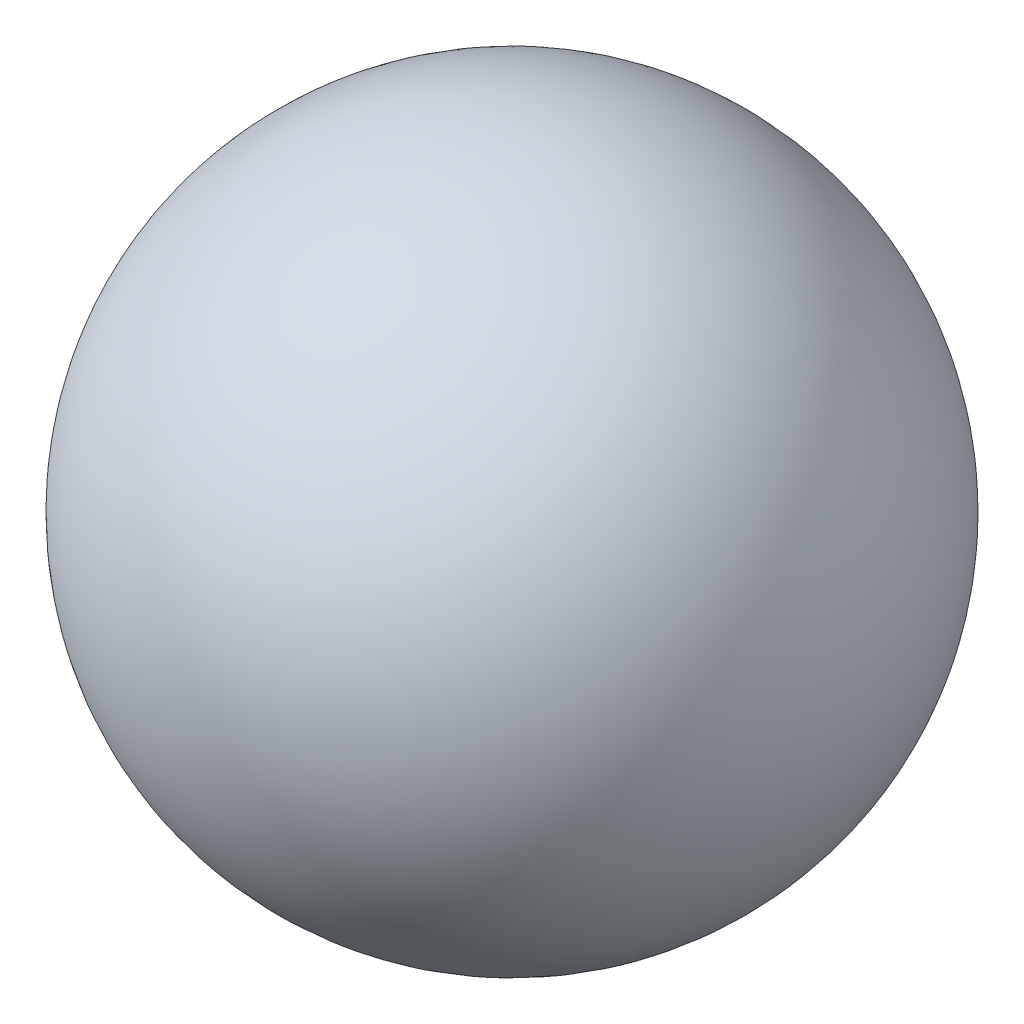
ISO-10303-21;
HEADER;
FILE_DESCRIPTION(('STEP AP214'),'2;1');
FILE_NAME('part.step','',(''),(''),'','','');
FILE_SCHEMA(('AUTOMOTIVE_DESIGN { 1 0 10303 214 1 1 1 1 }'));
ENDSEC;
DATA;
#1=APPLICATION_CONTEXT('core data for automotive mechanical design processes');
#2=APPLICATION_PROTOCOL_DEFINITION('international standard','automotive_design',2000,#1);
#3=PRODUCT_CONTEXT('',#1,'mechanical');
#4=PRODUCT('Part','Part','',(#3));
#5=PRODUCT_RELATED_PRODUCT_CATEGORY('part','',(#4));
#6=PRODUCT_DEFINITION_FORMATION('','',#4);
#7=PRODUCT_DEFINITION_CONTEXT('part definition',#1,'design');
#8=PRODUCT_DEFINITION('design','',#6,#7);
#9=PRODUCT_DEFINITION_SHAPE('','',#8);
#10=(LENGTH_UNIT() NAMED_UNIT(*) SI_UNIT(.MILLI.,.METRE.));
#11=(NAMED_UNIT(*) PLANE_ANGLE_UNIT() SI_UNIT($,.RADIAN.));
#12=(NAMED_UNIT(*) SI_UNIT($,.STERADIAN.) SOLID_ANGLE_UNIT());
#13=UNCERTAINTY_MEASURE_WITH_UNIT(LENGTH_MEASURE(1.E-05),#10,'distance_accuracy_value','');
#14=(GEOMETRIC_REPRESENTATION_CONTEXT(3) GLOBAL_UNCERTAINTY_ASSIGNED_CONTEXT((#13)) GLOBAL_UNIT_ASSIGNED_CONTEXT((#10,
#11,#12)) REPRESENTATION_CONTEXT('',''));
#15=CARTESIAN_POINT('',(0.,0.,0.));
#16=DIRECTION('',(0.,0.,1.));
#17=DIRECTION('',(1.,0.,0.));
#18=AXIS2_PLACEMENT_3D('',#15,#16,#17);
#19=CARTESIAN_POINT('',(0.,0.,0.));
#20=DIRECTION('',(0.,0.,1.));
#21=DIRECTION('',(1.,0.,0.));
#22=AXIS2_PLACEMENT_3D('',#19,#20,#21);
#23=ELLIPSE('',#22,600.,600.);
#24=TRIMMED_CURVE('',#23,(PARAMETER_VALUE(0.)),(PARAMETER_VALUE(3.14159265358979)),.T.,.PARAMETER.);
#25=CARTESIAN_POINT('',(-2000.,0.,0.));
#26=DIRECTION('',(-1.,0.,0.));
#27=AXIS1_PLACEMENT('',#25,#26);
#28=SURFACE_OF_REVOLUTION('',#24,#27);
#29=CARTESIAN_POINT('',(-600.,0.,0.));
#30=VERTEX_POINT('',#29);
#31=VERTEX_LOOP('',#30);
#32=FACE_BOUND('',#31,.T.);
#33=CARTESIAN_POINT('',(600.,0.,0.));
#34=VERTEX_POINT('',#33);
#35=VERTEX_LOOP('',#34);
#36=FACE_BOUND('',#35,.T.);
#37=ADVANCED_FACE('F25',(#32,#36),#28,.T.);
#38=CLOSED_SHELL('',(#37));
#39=MANIFOLD_SOLID_BREP('B2',#38);
#40=ADVANCED_BREP_SHAPE_REPRESENTATION('',(#18,#39),#14);
#41=SHAPE_DEFINITION_REPRESENTATION(#9,#40);
ENDSEC;
END-ISO-10303-21;
